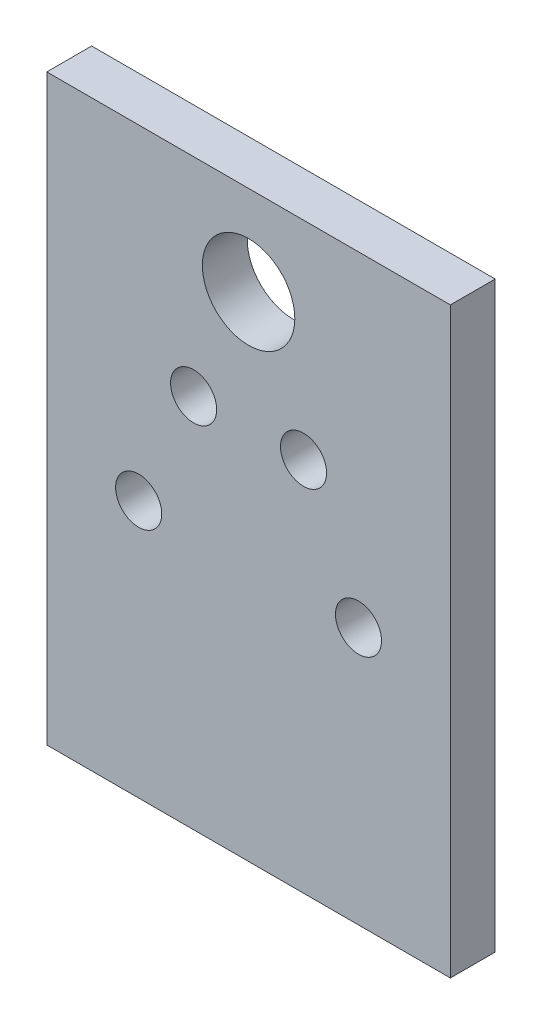
ISO-10303-21;
HEADER;
FILE_DESCRIPTION(('STEP AP214'),'2;1');
FILE_NAME('part.step','',(''),(''),'','','');
FILE_SCHEMA(('AUTOMOTIVE_DESIGN { 1 0 10303 214 1 1 1 1 }'));
ENDSEC;
DATA;
#1=APPLICATION_CONTEXT('core data for automotive mechanical design processes');
#2=APPLICATION_PROTOCOL_DEFINITION('international standard','automotive_design',2000,#1);
#3=PRODUCT_CONTEXT('',#1,'mechanical');
#4=PRODUCT('Part','Part','',(#3));
#5=PRODUCT_RELATED_PRODUCT_CATEGORY('part','',(#4));
#6=PRODUCT_DEFINITION_FORMATION('','',#4);
#7=PRODUCT_DEFINITION_CONTEXT('part definition',#1,'design');
#8=PRODUCT_DEFINITION('design','',#6,#7);
#9=PRODUCT_DEFINITION_SHAPE('','',#8);
#10=(LENGTH_UNIT() NAMED_UNIT(*) SI_UNIT(.MILLI.,.METRE.));
#11=(NAMED_UNIT(*) PLANE_ANGLE_UNIT() SI_UNIT($,.RADIAN.));
#12=(NAMED_UNIT(*) SI_UNIT($,.STERADIAN.) SOLID_ANGLE_UNIT());
#13=UNCERTAINTY_MEASURE_WITH_UNIT(LENGTH_MEASURE(1.E-05),#10,'distance_accuracy_value','');
#14=(GEOMETRIC_REPRESENTATION_CONTEXT(3) GLOBAL_UNCERTAINTY_ASSIGNED_CONTEXT((#13)) GLOBAL_UNIT_ASSIGNED_CONTEXT((#10,
#11,#12)) REPRESENTATION_CONTEXT('',''));
#15=CARTESIAN_POINT('',(0.,0.,0.));
#16=DIRECTION('',(0.,0.,1.));
#17=DIRECTION('',(1.,0.,0.));
#18=AXIS2_PLACEMENT_3D('',#15,#16,#17);
#19=CARTESIAN_POINT('',(0.,0.,6.35));
#20=DIRECTION('',(0.,0.,1.));
#21=DIRECTION('',(1.,0.,0.));
#22=AXIS2_PLACEMENT_3D('',#19,#20,#21);
#23=PLANE('',#22);
#24=CARTESIAN_POINT('',(7.78251528995487,40.46034210172,6.35));
#25=DIRECTION('',(0.,0.,1.));
#26=DIRECTION('',(-1.,0.,0.));
#27=AXIS2_PLACEMENT_3D('',#24,#25,#26);
#28=CIRCLE('',#27,3.26390000000001);
#29=CARTESIAN_POINT('',(4.51861528995486,40.46034210172,6.35));
#30=VERTEX_POINT('',#29);
#31=EDGE_CURVE('E144',#30,#30,#28,.T.);
#32=ORIENTED_EDGE('',*,*,#31,.F.);
#33=EDGE_LOOP('',(#32));
#34=FACE_BOUND('',#33,.T.);
#35=CARTESIAN_POINT('',(-7.78251528995487,40.46034210172,6.35));
#36=DIRECTION('',(0.,0.,1.));
#37=DIRECTION('',(1.,0.,0.));
#38=AXIS2_PLACEMENT_3D('',#35,#36,#37);
#39=CIRCLE('',#38,3.26390000000001);
#40=CARTESIAN_POINT('',(-4.51861528995486,40.46034210172,6.35));
#41=VERTEX_POINT('',#40);
#42=EDGE_CURVE('E152',#41,#41,#39,.T.);
#43=ORIENTED_EDGE('',*,*,#42,.F.);
#44=EDGE_LOOP('',(#43));
#45=FACE_BOUND('',#44,.T.);
#46=DIRECTION('',(0.,1.,0.));
#47=VECTOR('',#46,1.);
#48=CARTESIAN_POINT('',(28.575,12.7,6.35));
#49=LINE('',#48,#47);
#50=CARTESIAN_POINT('',(28.575,-12.7,6.35));
#51=VERTEX_POINT('',#50);
#52=CARTESIAN_POINT('',(28.575,69.85,6.35));
#53=VERTEX_POINT('',#52);
#54=EDGE_CURVE('E85',#51,#53,#49,.T.);
#55=ORIENTED_EDGE('',*,*,#54,.T.);
#56=DIRECTION('',(-1.,0.,0.));
#57=VECTOR('',#56,1.);
#58=CARTESIAN_POINT('',(-28.575,69.85,6.35));
#59=LINE('',#58,#57);
#60=CARTESIAN_POINT('',(-28.575,69.85,6.35));
#61=VERTEX_POINT('',#60);
#62=EDGE_CURVE('E88',#53,#61,#59,.T.);
#63=ORIENTED_EDGE('',*,*,#62,.T.);
#64=DIRECTION('',(0.,-1.,0.));
#65=VECTOR('',#64,1.);
#66=CARTESIAN_POINT('',(-28.575,57.15,6.35));
#67=LINE('',#66,#65);
#68=CARTESIAN_POINT('',(-28.575,-12.7,6.35));
#69=VERTEX_POINT('',#68);
#70=EDGE_CURVE('E92',#61,#69,#67,.T.);
#71=ORIENTED_EDGE('',*,*,#70,.T.);
#72=DIRECTION('',(1.,0.,0.));
#73=VECTOR('',#72,1.);
#74=CARTESIAN_POINT('',(-28.575,-12.7,6.35));
#75=LINE('',#74,#73);
#76=EDGE_CURVE('E57',#69,#51,#75,.T.);
#77=ORIENTED_EDGE('',*,*,#76,.T.);
#78=EDGE_LOOP('',(#55,#63,#71,#77));
#79=FACE_BOUND('',#78,.T.);
#80=CARTESIAN_POINT('',(0.,57.15,6.35));
#81=DIRECTION('',(0.,0.,1.));
#82=DIRECTION('',(1.,0.,0.));
#83=AXIS2_PLACEMENT_3D('',#80,#81,#82);
#84=CIRCLE('',#83,6.54812);
#85=CARTESIAN_POINT('',(6.54812,57.15,6.35));
#86=VERTEX_POINT('',#85);
#87=EDGE_CURVE('E106',#86,#86,#84,.T.);
#88=ORIENTED_EDGE('',*,*,#87,.F.);
#89=EDGE_LOOP('',(#88));
#90=FACE_BOUND('',#89,.T.);
#91=CARTESIAN_POINT('',(-15.5650305799097,23.7706842034401,6.35));
#92=DIRECTION('',(0.,0.,1.));
#93=DIRECTION('',(1.,0.,0.));
#94=AXIS2_PLACEMENT_3D('',#91,#92,#93);
#95=CIRCLE('',#94,3.26390000000003);
#96=CARTESIAN_POINT('',(-12.3011305799097,23.7706842034401,6.35));
#97=VERTEX_POINT('',#96);
#98=EDGE_CURVE('E148',#97,#97,#95,.T.);
#99=ORIENTED_EDGE('',*,*,#98,.F.);
#100=EDGE_LOOP('',(#99));
#101=FACE_BOUND('',#100,.T.);
#102=CARTESIAN_POINT('',(15.5650305799097,23.7706842034401,6.35));
#103=DIRECTION('',(0.,0.,1.));
#104=DIRECTION('',(-1.,0.,0.));
#105=AXIS2_PLACEMENT_3D('',#102,#103,#104);
#106=CIRCLE('',#105,3.2639);
#107=CARTESIAN_POINT('',(12.3011305799097,23.7706842034401,6.35));
#108=VERTEX_POINT('',#107);
#109=EDGE_CURVE('E139',#108,#108,#106,.T.);
#110=ORIENTED_EDGE('',*,*,#109,.F.);
#111=EDGE_LOOP('',(#110));
#112=FACE_BOUND('',#111,.T.);
#113=ADVANCED_FACE('F40',(#34,#45,#79,#90,#101,#112),#23,.T.);
#114=CARTESIAN_POINT('',(0.,0.,0.));
#115=DIRECTION('',(0.,0.,1.));
#116=DIRECTION('',(1.,0.,0.));
#117=AXIS2_PLACEMENT_3D('',#114,#115,#116);
#118=PLANE('',#117);
#119=DIRECTION('',(0.,1.,0.));
#120=VECTOR('',#119,1.);
#121=CARTESIAN_POINT('',(28.575,57.15,0.));
#122=LINE('',#121,#120);
#123=CARTESIAN_POINT('',(28.575,-12.7,0.));
#124=VERTEX_POINT('',#123);
#125=CARTESIAN_POINT('',(28.575,69.85,0.));
#126=VERTEX_POINT('',#125);
#127=EDGE_CURVE('E80',#124,#126,#122,.T.);
#128=ORIENTED_EDGE('',*,*,#127,.F.);
#129=DIRECTION('',(1.,0.,0.));
#130=VECTOR('',#129,1.);
#131=CARTESIAN_POINT('',(-28.575,-12.7,0.));
#132=LINE('',#131,#130);
#133=CARTESIAN_POINT('',(-28.575,-12.7,0.));
#134=VERTEX_POINT('',#133);
#135=EDGE_CURVE('E109',#134,#124,#132,.T.);
#136=ORIENTED_EDGE('',*,*,#135,.F.);
#137=DIRECTION('',(0.,-1.,0.));
#138=VECTOR('',#137,1.);
#139=CARTESIAN_POINT('',(-28.575,12.7,0.));
#140=LINE('',#139,#138);
#141=CARTESIAN_POINT('',(-28.575,69.85,0.));
#142=VERTEX_POINT('',#141);
#143=EDGE_CURVE('E73',#142,#134,#140,.T.);
#144=ORIENTED_EDGE('',*,*,#143,.F.);
#145=DIRECTION('',(-1.,0.,0.));
#146=VECTOR('',#145,1.);
#147=CARTESIAN_POINT('',(-28.575,69.85,0.));
#148=LINE('',#147,#146);
#149=EDGE_CURVE('E97',#126,#142,#148,.T.);
#150=ORIENTED_EDGE('',*,*,#149,.F.);
#151=EDGE_LOOP('',(#128,#136,#144,#150));
#152=FACE_BOUND('',#151,.T.);
#153=CARTESIAN_POINT('',(0.,57.15,0.));
#154=DIRECTION('',(0.,0.,1.));
#155=DIRECTION('',(1.,0.,0.));
#156=AXIS2_PLACEMENT_3D('',#153,#154,#155);
#157=CIRCLE('',#156,6.54812);
#158=CARTESIAN_POINT('',(6.54812,57.15,0.));
#159=VERTEX_POINT('',#158);
#160=EDGE_CURVE('E122',#159,#159,#157,.T.);
#161=ORIENTED_EDGE('',*,*,#160,.T.);
#162=EDGE_LOOP('',(#161));
#163=FACE_BOUND('',#162,.T.);
#164=CARTESIAN_POINT('',(-7.78251528995487,40.46034210172,0.));
#165=DIRECTION('',(0.,0.,1.));
#166=DIRECTION('',(1.,0.,0.));
#167=AXIS2_PLACEMENT_3D('',#164,#165,#166);
#168=CIRCLE('',#167,3.26390000000001);
#169=CARTESIAN_POINT('',(-4.51861528995486,40.46034210172,0.));
#170=VERTEX_POINT('',#169);
#171=EDGE_CURVE('E126',#170,#170,#168,.T.);
#172=ORIENTED_EDGE('',*,*,#171,.T.);
#173=EDGE_LOOP('',(#172));
#174=FACE_BOUND('',#173,.T.);
#175=CARTESIAN_POINT('',(-15.5650305799097,23.7706842034401,0.));
#176=DIRECTION('',(0.,0.,1.));
#177=DIRECTION('',(1.,0.,0.));
#178=AXIS2_PLACEMENT_3D('',#175,#176,#177);
#179=CIRCLE('',#178,3.26390000000003);
#180=CARTESIAN_POINT('',(-12.3011305799097,23.7706842034401,0.));
#181=VERTEX_POINT('',#180);
#182=EDGE_CURVE('E130',#181,#181,#179,.T.);
#183=ORIENTED_EDGE('',*,*,#182,.T.);
#184=EDGE_LOOP('',(#183));
#185=FACE_BOUND('',#184,.T.);
#186=CARTESIAN_POINT('',(7.78251528995487,40.46034210172,0.));
#187=DIRECTION('',(0.,0.,1.));
#188=DIRECTION('',(-1.,0.,0.));
#189=AXIS2_PLACEMENT_3D('',#186,#187,#188);
#190=CIRCLE('',#189,3.26390000000001);
#191=CARTESIAN_POINT('',(4.51861528995486,40.46034210172,0.));
#192=VERTEX_POINT('',#191);
#193=EDGE_CURVE('E134',#192,#192,#190,.T.);
#194=ORIENTED_EDGE('',*,*,#193,.T.);
#195=EDGE_LOOP('',(#194));
#196=FACE_BOUND('',#195,.T.);
#197=CARTESIAN_POINT('',(15.5650305799097,23.7706842034401,0.));
#198=DIRECTION('',(0.,0.,1.));
#199=DIRECTION('',(-1.,0.,0.));
#200=AXIS2_PLACEMENT_3D('',#197,#198,#199);
#201=CIRCLE('',#200,3.2639);
#202=CARTESIAN_POINT('',(12.3011305799097,23.7706842034401,0.));
#203=VERTEX_POINT('',#202);
#204=EDGE_CURVE('E137',#203,#203,#201,.T.);
#205=ORIENTED_EDGE('',*,*,#204,.T.);
#206=EDGE_LOOP('',(#205));
#207=FACE_BOUND('',#206,.T.);
#208=ADVANCED_FACE('F115',(#152,#163,#174,#185,#196,#207),#118,.F.);
#209=CARTESIAN_POINT('',(28.575,57.15,6.35));
#210=DIRECTION('',(-1.,0.,0.));
#211=DIRECTION('',(0.,0.,1.));
#212=AXIS2_PLACEMENT_3D('',#209,#210,#211);
#213=PLANE('',#212);
#214=ORIENTED_EDGE('',*,*,#127,.T.);
#215=DIRECTION('',(0.,0.,-1.));
#216=VECTOR('',#215,1.);
#217=CARTESIAN_POINT('',(28.575,69.85,6.35));
#218=LINE('',#217,#216);
#219=EDGE_CURVE('E11',#53,#126,#218,.T.);
#220=ORIENTED_EDGE('',*,*,#219,.F.);
#221=ORIENTED_EDGE('',*,*,#54,.F.);
#222=DIRECTION('',(0.,0.,-1.));
#223=VECTOR('',#222,1.);
#224=CARTESIAN_POINT('',(28.575,-12.7,6.35));
#225=LINE('',#224,#223);
#226=EDGE_CURVE('E101',#51,#124,#225,.T.);
#227=ORIENTED_EDGE('',*,*,#226,.T.);
#228=EDGE_LOOP('',(#214,#220,#221,#227));
#229=FACE_BOUND('',#228,.T.);
#230=ADVANCED_FACE('F42',(#229),#213,.F.);
#231=CARTESIAN_POINT('',(-28.575,69.85,6.35));
#232=DIRECTION('',(0.,-1.,0.));
#233=DIRECTION('',(0.,0.,-1.));
#234=AXIS2_PLACEMENT_3D('',#231,#232,#233);
#235=PLANE('',#234);
#236=ORIENTED_EDGE('',*,*,#149,.T.);
#237=DIRECTION('',(0.,0.,-1.));
#238=VECTOR('',#237,1.);
#239=CARTESIAN_POINT('',(-28.575,69.85,6.35));
#240=LINE('',#239,#238);
#241=EDGE_CURVE('E49',#61,#142,#240,.T.);
#242=ORIENTED_EDGE('',*,*,#241,.F.);
#243=ORIENTED_EDGE('',*,*,#62,.F.);
#244=ORIENTED_EDGE('',*,*,#219,.T.);
#245=EDGE_LOOP('',(#236,#242,#243,#244));
#246=FACE_BOUND('',#245,.T.);
#247=ADVANCED_FACE('F96',(#246),#235,.F.);
#248=CARTESIAN_POINT('',(-28.575,12.7,6.35));
#249=DIRECTION('',(1.,0.,0.));
#250=DIRECTION('',(0.,1.,0.));
#251=AXIS2_PLACEMENT_3D('',#248,#249,#250);
#252=PLANE('',#251);
#253=ORIENTED_EDGE('',*,*,#143,.T.);
#254=DIRECTION('',(0.,0.,-1.));
#255=VECTOR('',#254,1.);
#256=CARTESIAN_POINT('',(-28.575,-12.7,6.35));
#257=LINE('',#256,#255);
#258=EDGE_CURVE('E98',#69,#134,#257,.T.);
#259=ORIENTED_EDGE('',*,*,#258,.F.);
#260=ORIENTED_EDGE('',*,*,#70,.F.);
#261=ORIENTED_EDGE('',*,*,#241,.T.);
#262=EDGE_LOOP('',(#253,#259,#260,#261));
#263=FACE_BOUND('',#262,.T.);
#264=ADVANCED_FACE('F99',(#263),#252,.F.);
#265=CARTESIAN_POINT('',(-28.575,-12.7,6.35));
#266=DIRECTION('',(0.,1.,0.));
#267=DIRECTION('',(0.,0.,1.));
#268=AXIS2_PLACEMENT_3D('',#265,#266,#267);
#269=PLANE('',#268);
#270=ORIENTED_EDGE('',*,*,#135,.T.);
#271=ORIENTED_EDGE('',*,*,#226,.F.);
#272=ORIENTED_EDGE('',*,*,#76,.F.);
#273=ORIENTED_EDGE('',*,*,#258,.T.);
#274=EDGE_LOOP('',(#270,#271,#272,#273));
#275=FACE_BOUND('',#274,.T.);
#276=ADVANCED_FACE('F114',(#275),#269,.F.);
#277=CARTESIAN_POINT('',(0.,57.15,6.35));
#278=DIRECTION('',(0.,0.,-1.));
#279=DIRECTION('',(-1.,0.,0.));
#280=AXIS2_PLACEMENT_3D('',#277,#278,#279);
#281=CYLINDRICAL_SURFACE('',#280,6.54812);
#282=ORIENTED_EDGE('',*,*,#87,.T.);
#283=EDGE_LOOP('',(#282));
#284=FACE_BOUND('',#283,.T.);
#285=ORIENTED_EDGE('',*,*,#160,.F.);
#286=EDGE_LOOP('',(#285));
#287=FACE_BOUND('',#286,.T.);
#288=ADVANCED_FACE('F160',(#284,#287),#281,.F.);
#289=CARTESIAN_POINT('',(-7.78251528995487,40.46034210172,6.35));
#290=DIRECTION('',(0.,0.,-1.));
#291=DIRECTION('',(-1.,0.,0.));
#292=AXIS2_PLACEMENT_3D('',#289,#290,#291);
#293=CYLINDRICAL_SURFACE('',#292,3.26390000000001);
#294=ORIENTED_EDGE('',*,*,#42,.T.);
#295=EDGE_LOOP('',(#294));
#296=FACE_BOUND('',#295,.T.);
#297=ORIENTED_EDGE('',*,*,#171,.F.);
#298=EDGE_LOOP('',(#297));
#299=FACE_BOUND('',#298,.T.);
#300=ADVANCED_FACE('F183',(#296,#299),#293,.F.);
#301=CARTESIAN_POINT('',(-15.5650305799097,23.7706842034401,6.35));
#302=DIRECTION('',(0.,0.,-1.));
#303=DIRECTION('',(-1.,0.,0.));
#304=AXIS2_PLACEMENT_3D('',#301,#302,#303);
#305=CYLINDRICAL_SURFACE('',#304,3.26390000000003);
#306=ORIENTED_EDGE('',*,*,#98,.T.);
#307=EDGE_LOOP('',(#306));
#308=FACE_BOUND('',#307,.T.);
#309=ORIENTED_EDGE('',*,*,#182,.F.);
#310=EDGE_LOOP('',(#309));
#311=FACE_BOUND('',#310,.T.);
#312=ADVANCED_FACE('F177',(#308,#311),#305,.F.);
#313=CARTESIAN_POINT('',(7.78251528995487,40.46034210172,6.35));
#314=DIRECTION('',(0.,0.,-1.));
#315=DIRECTION('',(-1.,0.,0.));
#316=AXIS2_PLACEMENT_3D('',#313,#314,#315);
#317=CYLINDRICAL_SURFACE('',#316,3.26390000000001);
#318=ORIENTED_EDGE('',*,*,#31,.T.);
#319=EDGE_LOOP('',(#318));
#320=FACE_BOUND('',#319,.T.);
#321=ORIENTED_EDGE('',*,*,#193,.F.);
#322=EDGE_LOOP('',(#321));
#323=FACE_BOUND('',#322,.T.);
#324=ADVANCED_FACE('F172',(#320,#323),#317,.F.);
#325=CARTESIAN_POINT('',(15.5650305799097,23.7706842034401,6.35));
#326=DIRECTION('',(0.,0.,-1.));
#327=DIRECTION('',(-1.,0.,0.));
#328=AXIS2_PLACEMENT_3D('',#325,#326,#327);
#329=CYLINDRICAL_SURFACE('',#328,3.2639);
#330=ORIENTED_EDGE('',*,*,#109,.T.);
#331=EDGE_LOOP('',(#330));
#332=FACE_BOUND('',#331,.T.);
#333=ORIENTED_EDGE('',*,*,#204,.F.);
#334=EDGE_LOOP('',(#333));
#335=FACE_BOUND('',#334,.T.);
#336=ADVANCED_FACE('F170',(#332,#335),#329,.F.);
#337=CLOSED_SHELL('',(#113,#208,#230,#247,#264,#276,#288,#300,#312,#324,#336));
#338=MANIFOLD_SOLID_BREP('B2',#337);
#339=ADVANCED_BREP_SHAPE_REPRESENTATION('',(#18,#338),#14);
#340=SHAPE_DEFINITION_REPRESENTATION(#9,#339);
ENDSEC;
END-ISO-10303-21;
